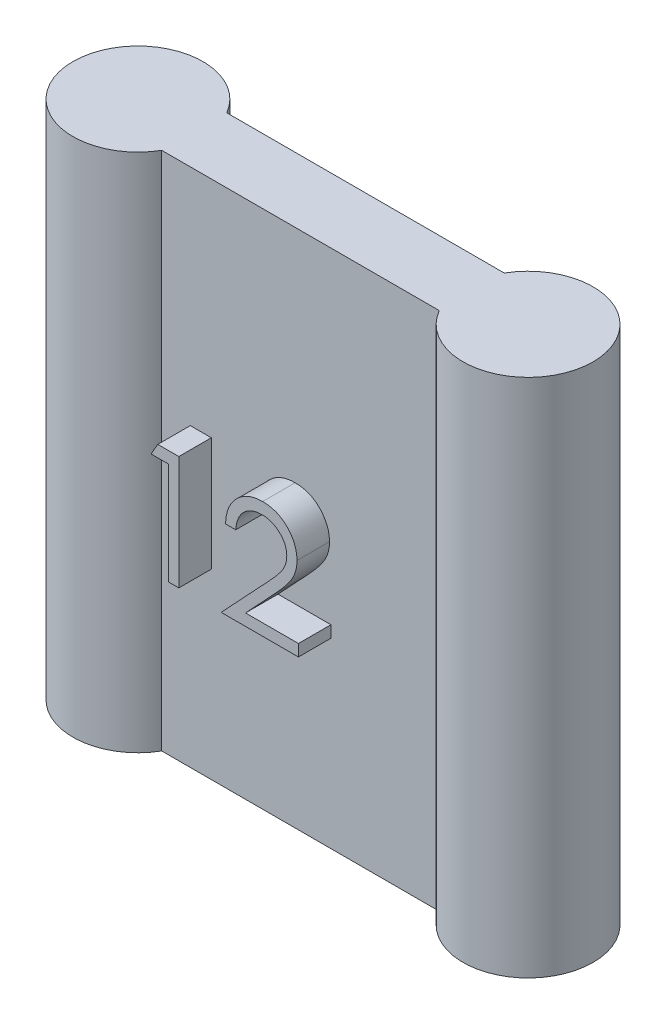
ISO-10303-21;
HEADER;
FILE_DESCRIPTION(('STEP AP214'),'2;1');
FILE_NAME('part.step','',(''),(''),'','','');
FILE_SCHEMA(('AUTOMOTIVE_DESIGN { 1 0 10303 214 1 1 1 1 }'));
ENDSEC;
DATA;
#1=APPLICATION_CONTEXT('core data for automotive mechanical design processes');
#2=APPLICATION_PROTOCOL_DEFINITION('international standard','automotive_design',2000,#1);
#3=PRODUCT_CONTEXT('',#1,'mechanical');
#4=PRODUCT('Part','Part','',(#3));
#5=PRODUCT_RELATED_PRODUCT_CATEGORY('part','',(#4));
#6=PRODUCT_DEFINITION_FORMATION('','',#4);
#7=PRODUCT_DEFINITION_CONTEXT('part definition',#1,'design');
#8=PRODUCT_DEFINITION('design','',#6,#7);
#9=PRODUCT_DEFINITION_SHAPE('','',#8);
#10=(LENGTH_UNIT() NAMED_UNIT(*) SI_UNIT(.MILLI.,.METRE.));
#11=(NAMED_UNIT(*) PLANE_ANGLE_UNIT() SI_UNIT($,.RADIAN.));
#12=(NAMED_UNIT(*) SI_UNIT($,.STERADIAN.) SOLID_ANGLE_UNIT());
#13=UNCERTAINTY_MEASURE_WITH_UNIT(LENGTH_MEASURE(1.E-05),#10,'distance_accuracy_value','');
#14=(GEOMETRIC_REPRESENTATION_CONTEXT(3) GLOBAL_UNCERTAINTY_ASSIGNED_CONTEXT((#13)) GLOBAL_UNIT_ASSIGNED_CONTEXT((#10,
#11,#12)) REPRESENTATION_CONTEXT('',''));
#15=CARTESIAN_POINT('',(0.,0.,0.));
#16=DIRECTION('',(0.,0.,1.));
#17=DIRECTION('',(1.,0.,0.));
#18=AXIS2_PLACEMENT_3D('',#15,#16,#17);
#19=CARTESIAN_POINT('',(6.,-8.,2.));
#20=DIRECTION('',(0.,1.,0.));
#21=DIRECTION('',(0.,0.,1.));
#22=AXIS2_PLACEMENT_3D('',#19,#20,#21);
#23=PLANE('',#22);
#24=DIRECTION('',(1.,0.,0.));
#25=VECTOR('',#24,1.);
#26=CARTESIAN_POINT('',(6.,-8.,0.));
#27=LINE('',#26,#25);
#28=CARTESIAN_POINT('',(-4.26794919243112,-8.,0.));
#29=VERTEX_POINT('',#28);
#30=CARTESIAN_POINT('',(4.26794919243113,-8.,0.));
#31=VERTEX_POINT('',#30);
#32=EDGE_CURVE('E291',#29,#31,#27,.T.);
#33=ORIENTED_EDGE('',*,*,#32,.T.);
#34=CARTESIAN_POINT('',(6.,-8.,1.));
#35=DIRECTION('',(0.,-1.,0.));
#36=DIRECTION('',(1.,0.,0.));
#37=AXIS2_PLACEMENT_3D('',#34,#35,#36);
#38=CIRCLE('',#37,2.);
#39=CARTESIAN_POINT('',(4.26794919243113,-8.,2.));
#40=VERTEX_POINT('',#39);
#41=EDGE_CURVE('E304',#31,#40,#38,.T.);
#42=ORIENTED_EDGE('',*,*,#41,.T.);
#43=DIRECTION('',(1.,0.,0.));
#44=VECTOR('',#43,1.);
#45=CARTESIAN_POINT('',(6.,-8.,2.));
#46=LINE('',#45,#44);
#47=CARTESIAN_POINT('',(-4.26794919243112,-8.,2.));
#48=VERTEX_POINT('',#47);
#49=EDGE_CURVE('E284',#48,#40,#46,.T.);
#50=ORIENTED_EDGE('',*,*,#49,.F.);
#51=CARTESIAN_POINT('',(-6.,-8.,1.));
#52=DIRECTION('',(0.,-1.,0.));
#53=DIRECTION('',(1.,0.,0.));
#54=AXIS2_PLACEMENT_3D('',#51,#52,#53);
#55=CIRCLE('',#54,2.);
#56=EDGE_CURVE('E299',#48,#29,#55,.T.);
#57=ORIENTED_EDGE('',*,*,#56,.T.);
#58=EDGE_LOOP('',(#33,#42,#50,#57));
#59=FACE_BOUND('',#58,.T.);
#60=ADVANCED_FACE('F33',(#59),#23,.F.);
#61=CARTESIAN_POINT('',(6.,8.,2.));
#62=DIRECTION('',(0.,-1.,0.));
#63=DIRECTION('',(0.,0.,-1.));
#64=AXIS2_PLACEMENT_3D('',#61,#62,#63);
#65=PLANE('',#64);
#66=DIRECTION('',(-1.,0.,0.));
#67=VECTOR('',#66,1.);
#68=CARTESIAN_POINT('',(6.,8.,2.));
#69=LINE('',#68,#67);
#70=CARTESIAN_POINT('',(4.26794919243112,8.,2.));
#71=VERTEX_POINT('',#70);
#72=CARTESIAN_POINT('',(-4.26794919243112,8.,2.));
#73=VERTEX_POINT('',#72);
#74=EDGE_CURVE('E276',#71,#73,#69,.T.);
#75=ORIENTED_EDGE('',*,*,#74,.F.);
#76=CARTESIAN_POINT('',(6.,8.,1.));
#77=DIRECTION('',(0.,-1.,0.));
#78=DIRECTION('',(0.,0.,-1.));
#79=AXIS2_PLACEMENT_3D('',#76,#77,#78);
#80=CIRCLE('',#79,2.);
#81=CARTESIAN_POINT('',(4.26794919243112,8.,0.));
#82=VERTEX_POINT('',#81);
#83=EDGE_CURVE('E277',#71,#82,#80,.F.);
#84=ORIENTED_EDGE('',*,*,#83,.T.);
#85=DIRECTION('',(-1.,0.,0.));
#86=VECTOR('',#85,1.);
#87=CARTESIAN_POINT('',(6.,8.,0.));
#88=LINE('',#87,#86);
#89=CARTESIAN_POINT('',(-4.26794919243112,8.,0.));
#90=VERTEX_POINT('',#89);
#91=EDGE_CURVE('E287',#82,#90,#88,.T.);
#92=ORIENTED_EDGE('',*,*,#91,.T.);
#93=CARTESIAN_POINT('',(-6.,8.,1.));
#94=DIRECTION('',(0.,-1.,0.));
#95=DIRECTION('',(0.,0.,-1.));
#96=AXIS2_PLACEMENT_3D('',#93,#94,#95);
#97=CIRCLE('',#96,2.);
#98=EDGE_CURVE('E279',#90,#73,#97,.F.);
#99=ORIENTED_EDGE('',*,*,#98,.T.);
#100=EDGE_LOOP('',(#75,#84,#92,#99));
#101=FACE_BOUND('',#100,.T.);
#102=ADVANCED_FACE('F264',(#101),#65,.F.);
#103=CARTESIAN_POINT('',(0.,0.,2.));
#104=DIRECTION('',(0.,0.,-1.));
#105=DIRECTION('',(-1.,0.,0.));
#106=AXIS2_PLACEMENT_3D('',#103,#104,#105);
#107=PLANE('',#106);
#108=CARTESIAN_POINT('',(0.578204653722721,0.127970887786358,2.));
#109=CARTESIAN_POINT('',(0.577568911423302,0.151852286197168,2.));
#110=CARTESIAN_POINT('',(0.576315985431715,0.198917936558474,2.));
#111=CARTESIAN_POINT('',(0.565258287937912,0.267923695577093,2.));
#112=CARTESIAN_POINT('',(0.548547781843404,0.334488509392884,2.));
#113=CARTESIAN_POINT('',(0.524602523795471,0.39881712851072,2.));
#114=CARTESIAN_POINT('',(0.492995783710131,0.460262780576897,2.));
#115=CARTESIAN_POINT('',(0.454522403792534,0.518900260780499,2.));
#116=CARTESIAN_POINT('',(0.410132340374669,0.575589225980579,2.));
#117=CARTESIAN_POINT('',(0.358781071043801,0.628742524038654,2.));
#118=CARTESIAN_POINT('',(0.302369551237218,0.677423729521116,2.));
#119=CARTESIAN_POINT('',(0.242775301651988,0.720547814935484,2.));
#120=CARTESIAN_POINT('',(0.179725197392077,0.756586925734305,2.));
#121=CARTESIAN_POINT('',(0.113485075216256,0.786130422914732,2.));
#122=CARTESIAN_POINT('',(0.0442396058079003,0.809305804111072,2.));
#123=CARTESIAN_POINT('',(-0.0281451393144922,0.82536438353418,2.));
#124=CARTESIAN_POINT('',(-0.103469155596994,0.835446867480815,2.));
#125=CARTESIAN_POINT('',(-0.154902651287634,0.836811039389183,2.));
#126=CARTESIAN_POINT('',(-0.181110250123432,0.837506144196614,2.));
#127=B_SPLINE_CURVE_WITH_KNOTS('',3,(#108,#109,#110,#111,#112,#113,#114,#115,#116,#117,#118,
#119,#120,#121,#122,#123,#124,#125,#126),.UNSPECIFIED.,.F.,.F.,(4,1,1,1,1,1,1,1,1,1,1,1,1,1,1,1,
4),(0.,0.0619654006870625,0.122121905638296,0.180988496849842,0.239933216451903,
0.299905831106524,0.359988847476987,0.421775741741646,0.486575826421126,0.551534804619741,
0.61501754275998,0.677258616661657,0.739729962362713,0.803050102662951,0.866495132015698,
0.931973474177149,1.),.UNSPECIFIED.);
#128=CARTESIAN_POINT('',(0.578204653722721,0.127970887786358,2.));
#129=VERTEX_POINT('',#128);
#130=CARTESIAN_POINT('',(-0.181110250123432,0.837506144196614,2.));
#131=VERTEX_POINT('',#130);
#132=EDGE_CURVE('E207',#129,#131,#127,.T.);
#133=ORIENTED_EDGE('',*,*,#132,.T.);
#134=CARTESIAN_POINT('',(-0.181110250123432,0.837506144196614,2.));
#135=CARTESIAN_POINT('',(-0.208481082879757,0.836791111932682,2.));
#136=CARTESIAN_POINT('',(-0.262232879099316,0.835386906628318,2.));
#137=CARTESIAN_POINT('',(-0.341151912035856,0.825564242636293,2.));
#138=CARTESIAN_POINT('',(-0.416437689559718,0.808618402239357,2.));
#139=CARTESIAN_POINT('',(-0.488279592512636,0.78544172785234,2.));
#140=CARTESIAN_POINT('',(-0.556799178325362,0.755983179030015,2.));
#141=CARTESIAN_POINT('',(-0.621663222362686,0.719291434351245,2.));
#142=CARTESIAN_POINT('',(-0.682726111622604,0.675507941198702,2.));
#143=CARTESIAN_POINT('',(-0.740102634968096,0.625867384874658,2.));
#144=CARTESIAN_POINT('',(-0.792966614031641,0.570599783658731,2.));
#145=CARTESIAN_POINT('',(-0.839413489896559,0.508989820591785,2.));
#146=CARTESIAN_POINT('',(-0.879997504040192,0.442162405220692,2.));
#147=CARTESIAN_POINT('',(-0.91540673751999,0.370297854651341,2.));
#148=CARTESIAN_POINT('',(-0.94416242760276,0.292744074666832,2.));
#149=CARTESIAN_POINT('',(-0.966135578033861,0.209776369818383,2.));
#150=CARTESIAN_POINT('',(-0.983522424755474,0.121754988379835,2.));
#151=CARTESIAN_POINT('',(-0.989330945360324,0.0609699035232617,2.));
#152=CARTESIAN_POINT('',(-0.992308166790099,0.0298138365043064,2.));
#153=B_SPLINE_CURVE_WITH_KNOTS('',3,(#134,#135,#136,#137,#138,#139,#140,#141,#142,#143,#144,
#145,#146,#147,#148,#149,#150,#151,#152),.UNSPECIFIED.,.F.,.F.,(4,1,1,1,1,1,1,1,1,1,1,1,1,1,1,1,
4),(0.,0.0644386715952429,0.126546911271678,0.186887153436571,0.245877535589455,
0.304040884691267,0.362191218072661,0.420975932791645,0.480660283279666,0.540600274953758,
0.600689098349453,0.661935789757195,0.724442505913983,0.789038393881744,0.856313757050995,
0.926352028205863,1.),.UNSPECIFIED.);
#154=CARTESIAN_POINT('',(-0.992308166790099,0.0298138365043064,2.));
#155=VERTEX_POINT('',#154);
#156=EDGE_CURVE('E427',#131,#155,#153,.T.);
#157=ORIENTED_EDGE('',*,*,#156,.T.);
#158=DIRECTION('',(-1.,0.,0.));
#159=VECTOR('',#158,1.);
#160=CARTESIAN_POINT('',(-0.992308166790099,0.0298138365043064,2.));
#161=LINE('',#160,#159);
#162=CARTESIAN_POINT('',(-1.30641073089266,0.0298138365043064,2.));
#163=VERTEX_POINT('',#162);
#164=EDGE_CURVE('E186',#155,#163,#161,.T.);
#165=ORIENTED_EDGE('',*,*,#164,.T.);
#166=CARTESIAN_POINT('',(-1.30641073089266,0.0298138365043064,2.));
#167=CARTESIAN_POINT('',(-1.30436357788473,0.0714847242721028,2.));
#168=CARTESIAN_POINT('',(-1.30034302385872,0.153325238847007,2.));
#169=CARTESIAN_POINT('',(-1.28151473459698,0.272649145246096,2.));
#170=CARTESIAN_POINT('',(-1.25457385739211,0.386703943970959,2.));
#171=CARTESIAN_POINT('',(-1.2164824033773,0.494573857940616,2.));
#172=CARTESIAN_POINT('',(-1.16917612560754,0.597212665170941,2.));
#173=CARTESIAN_POINT('',(-1.11244609822664,0.694212680862224,2.));
#174=CARTESIAN_POINT('',(-1.04525224771322,0.785203869576829,2.));
#175=CARTESIAN_POINT('',(-0.969045513667793,0.869342712872297,2.));
#176=CARTESIAN_POINT('',(-0.886276874612791,0.946530283671633,2.));
#177=CARTESIAN_POINT('',(-0.796970935141752,1.0131855264778,2.));
#178=CARTESIAN_POINT('',(-0.703125907855446,1.06950319783977,2.));
#179=CARTESIAN_POINT('',(-0.605026508890053,1.11658443966362,2.));
#180=CARTESIAN_POINT('',(-0.501565945330598,1.15192428558615,2.));
#181=CARTESIAN_POINT('',(-0.393683087491155,1.17814592519074,2.));
#182=CARTESIAN_POINT('',(-0.280903951081718,1.19392227091231,2.));
#183=CARTESIAN_POINT('',(-0.204063929034784,1.19561805651661,2.));
#184=CARTESIAN_POINT('',(-0.164984448841381,1.19648050317097,2.));
#185=B_SPLINE_CURVE_WITH_KNOTS('',3,(#166,#167,#168,#169,#170,#171,#172,#173,#174,#175,#176,
#177,#178,#179,#180,#181,#182,#183,#184),.UNSPECIFIED.,.F.,.F.,(4,1,1,1,1,1,1,1,1,1,1,1,1,1,1,1,
4),(0.,0.0687907943906181,0.135103289431128,0.198978674310651,0.261904299780856,
0.323494969367969,0.385195377966051,0.446969238740774,0.509764776703132,0.572250568847368,
0.633405175661153,0.693251162921753,0.75258316278567,0.812579266153421,0.873275084920192,
0.935549942895029,1.),.UNSPECIFIED.);
#186=CARTESIAN_POINT('',(-0.164984448841381,1.19648050317097,2.));
#187=VERTEX_POINT('',#186);
#188=EDGE_CURVE('E47',#163,#187,#185,.T.);
#189=ORIENTED_EDGE('',*,*,#188,.T.);
#190=CARTESIAN_POINT('',(-0.164984448841381,1.19648050317097,2.));
#191=CARTESIAN_POINT('',(-0.126606374754038,1.19558204672555,2.));
#192=CARTESIAN_POINT('',(-0.0511948300976275,1.19381661190456,2.));
#193=CARTESIAN_POINT('',(0.0588671843552584,1.17865558263733,2.));
#194=CARTESIAN_POINT('',(0.163644478818641,1.15490999100204,2.));
#195=CARTESIAN_POINT('',(0.262932245340542,1.12159457468874,2.));
#196=CARTESIAN_POINT('',(0.355938309911792,1.07681014729621,2.));
#197=CARTESIAN_POINT('',(0.44336135446814,1.02301260863806,2.));
#198=CARTESIAN_POINT('',(0.52624216525914,0.960792777265897,2.));
#199=CARTESIAN_POINT('',(0.600848948871302,0.887538963817508,2.));
#200=CARTESIAN_POINT('',(0.669357028107557,0.809336579347145,2.));
#201=CARTESIAN_POINT('',(0.728459283251832,0.725848675734995,2.));
#202=CARTESIAN_POINT('',(0.779072446725158,0.639619390019976,2.));
#203=CARTESIAN_POINT('',(0.821260126606338,0.549991188438465,2.));
#204=CARTESIAN_POINT('',(0.852316265545468,0.456120160025773,2.));
#205=CARTESIAN_POINT('',(0.875894473574838,0.359372957234126,2.));
#206=CARTESIAN_POINT('',(0.88922188726293,0.258748146227562,2.));
#207=CARTESIAN_POINT('',(0.891267310760781,0.190641590579818,2.));
#208=CARTESIAN_POINT('',(0.892307217825286,0.15601575958123,2.));
#209=B_SPLINE_CURVE_WITH_KNOTS('',3,(#190,#191,#192,#193,#194,#195,#196,#197,#198,#199,#200,
#201,#202,#203,#204,#205,#206,#207,#208),.UNSPECIFIED.,.F.,.F.,(4,1,1,1,1,1,1,1,1,1,1,1,1,1,1,1,
4),(0.,0.0694754602496704,0.136516797617799,0.200788823609261,0.263829672855826,
0.32573502296542,0.387290692215291,0.449509218762603,0.512967819545441,0.576275215493061,
0.637580100263924,0.697902605917102,0.757172088426985,0.816598528488655,0.87665317089282,
0.93728964241024,1.),.UNSPECIFIED.);
#210=CARTESIAN_POINT('',(0.892307217825286,0.15601575958123,2.));
#211=VERTEX_POINT('',#210);
#212=EDGE_CURVE('E409',#187,#211,#209,.T.);
#213=ORIENTED_EDGE('',*,*,#212,.T.);
#214=CARTESIAN_POINT('',(0.892307217825286,0.15601575958123,2.));
#215=CARTESIAN_POINT('',(0.890613954968804,0.107267925006404,2.));
#216=CARTESIAN_POINT('',(0.887257143621635,0.0106277113358799,2.));
#217=CARTESIAN_POINT('',(0.858542767054218,-0.131387151413306,2.));
#218=CARTESIAN_POINT('',(0.813696255958765,-0.268980570499981,2.));
#219=CARTESIAN_POINT('',(0.759698899109418,-0.379717872584427,2.));
#220=CARTESIAN_POINT('',(0.705226455047737,-0.468951366341458,2.));
#221=CARTESIAN_POINT('',(0.656138947454091,-0.5424200712612,2.));
#222=CARTESIAN_POINT('',(0.598674136432285,-0.621525539650599,2.));
#223=CARTESIAN_POINT('',(0.531995638469596,-0.706002877024552,2.));
#224=CARTESIAN_POINT('',(0.457482766318859,-0.796513782123112,2.));
#225=CARTESIAN_POINT('',(0.374460602962224,-0.89300357752152,2.));
#226=CARTESIAN_POINT('',(0.282337120940826,-0.994475347341573,2.));
#227=CARTESIAN_POINT('',(0.217678620186486,-1.0637809487294,2.));
#228=CARTESIAN_POINT('',(0.184174205004773,-1.09969337503416,2.));
#229=B_SPLINE_CURVE_WITH_KNOTS('',3,(#214,#215,#216,#217,#218,#219,#220,#221,#222,#223,#224,
#225,#226,#227,#228),.UNSPECIFIED.,.F.,.F.,(4,1,1,1,1,1,1,1,1,1,1,1,4),(0.,0.0987021963061527,
0.195672308810664,0.292422426507954,0.391342543799825,0.444462440671892,0.504228775449316,
0.570352337994678,0.642545753097748,0.722287505344018,0.807921122682712,0.900469537985015,1.),.UNSPECIFIED.);
#230=CARTESIAN_POINT('',(0.184174205004773,-1.09969337503416,2.));
#231=VERTEX_POINT('',#230);
#232=EDGE_CURVE('E404',#211,#231,#229,.T.);
#233=ORIENTED_EDGE('',*,*,#232,.T.);
#234=DIRECTION('',(-0.683740795861405,-0.729724964678345,0.));
#235=VECTOR('',#234,1.);
#236=CARTESIAN_POINT('',(0.184174205004773,-1.09969337503416,2.));
#237=LINE('',#236,#235);
#238=CARTESIAN_POINT('',(-0.691526916790099,-2.03428872759826,2.));
#239=VERTEX_POINT('',#238);
#240=EDGE_CURVE('E401',#231,#239,#237,.T.);
#241=ORIENTED_EDGE('',*,*,#240,.T.);
#242=DIRECTION('',(1.,0.,0.));
#243=VECTOR('',#242,1.);
#244=CARTESIAN_POINT('',(-0.691526916790099,-2.03428872759826,2.));
#245=LINE('',#244,#243);
#246=CARTESIAN_POINT('',(0.93717901269708,-2.03428872759826,2.));
#247=VERTEX_POINT('',#246);
#248=EDGE_CURVE('E398',#239,#247,#245,.T.);
#249=ORIENTED_EDGE('',*,*,#248,.T.);
#250=DIRECTION('',(0.,-1.,0.));
#251=VECTOR('',#250,1.);
#252=CARTESIAN_POINT('',(0.93717901269708,-2.03428872759826,2.));
#253=LINE('',#252,#251);
#254=CARTESIAN_POINT('',(0.93717901269708,-2.39326308657262,2.));
#255=VERTEX_POINT('',#254);
#256=EDGE_CURVE('E395',#247,#255,#253,.T.);
#257=ORIENTED_EDGE('',*,*,#256,.T.);
#258=DIRECTION('',(-1.,0.,0.));
#259=VECTOR('',#258,1.);
#260=CARTESIAN_POINT('',(0.93717901269708,-2.39326308657262,2.));
#261=LINE('',#260,#259);
#262=CARTESIAN_POINT('',(-1.44102611550805,-2.39326308657262,2.));
#263=VERTEX_POINT('',#262);
#264=EDGE_CURVE('E392',#255,#263,#261,.T.);
#265=ORIENTED_EDGE('',*,*,#264,.T.);
#266=DIRECTION('',(0.683776631973393,0.729691385153424,0.));
#267=VECTOR('',#266,1.);
#268=CARTESIAN_POINT('',(-1.44102611550805,-2.39326308657262,2.));
#269=LINE('',#268,#267);
#270=CARTESIAN_POINT('',(-0.0836543206362529,-0.944745458367489,2.));
#271=VERTEX_POINT('',#270);
#272=EDGE_CURVE('E386',#263,#271,#269,.T.);
#273=ORIENTED_EDGE('',*,*,#272,.T.);
#274=CARTESIAN_POINT('',(-0.0836543206362529,-0.944745458367489,2.));
#275=CARTESIAN_POINT('',(-0.0506064338283985,-0.910247151818881,2.));
#276=CARTESIAN_POINT('',(0.0128717932905046,-0.843982965214682,2.));
#277=CARTESIAN_POINT('',(0.102654370099705,-0.747240005080661,2.));
#278=CARTESIAN_POINT('',(0.18329335841211,-0.657490464328541,2.));
#279=CARTESIAN_POINT('',(0.255310751183933,-0.574903915884057,2.));
#280=CARTESIAN_POINT('',(0.317144256549756,-0.498272348088539,2.));
#281=CARTESIAN_POINT('',(0.372016488497533,-0.430077644500787,2.));
#282=CARTESIAN_POINT('',(0.415982079479605,-0.367323194192879,2.));
#283=CARTESIAN_POINT('',(0.463697475167276,-0.294582580280349,2.));
#284=CARTESIAN_POINT('',(0.509911456565501,-0.205770263106293,2.));
#285=CARTESIAN_POINT('',(0.549623812605896,-0.0972365738452463,2.));
#286=CARTESIAN_POINT('',(0.573838661054518,0.0144906788307417,2.));
#287=CARTESIAN_POINT('',(0.576743496560344,0.0899927158780106,2.));
#288=CARTESIAN_POINT('',(0.578204653722721,0.127970887786358,2.));
#289=B_SPLINE_CURVE_WITH_KNOTS('',3,(#274,#275,#276,#277,#278,#279,#280,#281,#282,#283,#284,
#285,#286,#287,#288),.UNSPECIFIED.,.F.,.F.,(4,1,1,1,1,1,1,1,1,1,1,1,4),(0.,0.110802643801319,
0.21282920234777,0.306101309823111,0.39064732111601,0.466924469360852,0.534481039284031,
0.593586940965673,0.644557004508718,0.736200452629373,0.825024025618864,0.911985584829758,1.),.UNSPECIFIED.);
#290=EDGE_CURVE('E210',#271,#129,#289,.T.);
#291=ORIENTED_EDGE('',*,*,#290,.T.);
#292=EDGE_LOOP('',(#133,#157,#165,#189,#213,#233,#241,#249,#257,#265,#273,#291));
#293=FACE_BOUND('',#292,.T.);
#294=DIRECTION('',(-1.,0.,0.));
#295=VECTOR('',#294,1.);
#296=CARTESIAN_POINT('',(-3.05641073089266,0.747762554453025,2.));
#297=LINE('',#296,#295);
#298=CARTESIAN_POINT('',(-3.05641073089266,0.747762554453025,2.));
#299=VERTEX_POINT('',#298);
#300=CARTESIAN_POINT('',(-3.5948722693542,0.747762554453025,2.));
#301=VERTEX_POINT('',#300);
#302=EDGE_CURVE('E324',#299,#301,#297,.T.);
#303=ORIENTED_EDGE('',*,*,#302,.T.);
#304=DIRECTION('',(0.496686511837685,0.867930013859708,0.));
#305=VECTOR('',#304,1.);
#306=CARTESIAN_POINT('',(-3.5948722693542,0.747762554453025,2.));
#307=LINE('',#306,#305);
#308=CARTESIAN_POINT('',(-3.38944358345677,1.10673691342738,2.));
#309=VERTEX_POINT('',#308);
#310=EDGE_CURVE('E338',#301,#309,#307,.T.);
#311=ORIENTED_EDGE('',*,*,#310,.T.);
#312=DIRECTION('',(1.,0.,0.));
#313=VECTOR('',#312,1.);
#314=CARTESIAN_POINT('',(-3.38944358345677,1.10673691342738,2.));
#315=LINE('',#314,#313);
#316=CARTESIAN_POINT('',(-2.7423081667901,1.10673691342738,2.));
#317=VERTEX_POINT('',#316);
#318=EDGE_CURVE('E335',#309,#317,#315,.T.);
#319=ORIENTED_EDGE('',*,*,#318,.T.);
#320=DIRECTION('',(0.,-1.,0.));
#321=VECTOR('',#320,1.);
#322=CARTESIAN_POINT('',(-2.7423081667901,1.10673691342738,2.));
#323=LINE('',#322,#321);
#324=CARTESIAN_POINT('',(-2.7423081667901,-2.39326308657262,2.));
#325=VERTEX_POINT('',#324);
#326=EDGE_CURVE('E55',#317,#325,#323,.T.);
#327=ORIENTED_EDGE('',*,*,#326,.T.);
#328=DIRECTION('',(-1.,0.,0.));
#329=VECTOR('',#328,1.);
#330=CARTESIAN_POINT('',(-2.7423081667901,-2.39326308657262,2.));
#331=LINE('',#330,#329);
#332=CARTESIAN_POINT('',(-3.05641073089266,-2.39326308657262,2.));
#333=VERTEX_POINT('',#332);
#334=EDGE_CURVE('E331',#325,#333,#331,.T.);
#335=ORIENTED_EDGE('',*,*,#334,.T.);
#336=DIRECTION('',(0.,1.,0.));
#337=VECTOR('',#336,1.);
#338=CARTESIAN_POINT('',(-3.05641073089266,-2.39326308657262,2.));
#339=LINE('',#338,#337);
#340=EDGE_CURVE('E328',#333,#299,#339,.T.);
#341=ORIENTED_EDGE('',*,*,#340,.T.);
#342=EDGE_LOOP('',(#303,#311,#319,#327,#335,#341));
#343=FACE_BOUND('',#342,.T.);
#344=ORIENTED_EDGE('',*,*,#49,.T.);
#345=DIRECTION('',(0.,-1.,0.));
#346=VECTOR('',#345,1.);
#347=CARTESIAN_POINT('',(4.26794919243112,13.6568542494924,2.));
#348=LINE('',#347,#346);
#349=EDGE_CURVE('E305',#40,#71,#348,.F.);
#350=ORIENTED_EDGE('',*,*,#349,.T.);
#351=ORIENTED_EDGE('',*,*,#74,.T.);
#352=DIRECTION('',(0.,-1.,0.));
#353=VECTOR('',#352,1.);
#354=CARTESIAN_POINT('',(-4.26794919243113,13.6568542494924,2.));
#355=LINE('',#354,#353);
#356=EDGE_CURVE('E294',#73,#48,#355,.T.);
#357=ORIENTED_EDGE('',*,*,#356,.T.);
#358=EDGE_LOOP('',(#344,#350,#351,#357));
#359=FACE_BOUND('',#358,.T.);
#360=ADVANCED_FACE('F261',(#293,#343,#359),#107,.F.);
#361=CARTESIAN_POINT('',(0.,0.,0.));
#362=DIRECTION('',(0.,0.,-1.));
#363=DIRECTION('',(-1.,0.,0.));
#364=AXIS2_PLACEMENT_3D('',#361,#362,#363);
#365=PLANE('',#364);
#366=DIRECTION('',(0.,-1.,0.));
#367=VECTOR('',#366,1.);
#368=CARTESIAN_POINT('',(4.26794919243112,13.6568542494924,0.));
#369=LINE('',#368,#367);
#370=EDGE_CURVE('E11',#31,#82,#369,.F.);
#371=ORIENTED_EDGE('',*,*,#370,.F.);
#372=ORIENTED_EDGE('',*,*,#32,.F.);
#373=DIRECTION('',(0.,-1.,0.));
#374=VECTOR('',#373,1.);
#375=CARTESIAN_POINT('',(-4.26794919243113,13.6568542494924,0.));
#376=LINE('',#375,#374);
#377=EDGE_CURVE('E40',#90,#29,#376,.T.);
#378=ORIENTED_EDGE('',*,*,#377,.F.);
#379=ORIENTED_EDGE('',*,*,#91,.F.);
#380=EDGE_LOOP('',(#371,#372,#378,#379));
#381=FACE_BOUND('',#380,.T.);
#382=ADVANCED_FACE('F259',(#381),#365,.T.);
#383=CARTESIAN_POINT('',(-6.,13.6568542494924,1.));
#384=DIRECTION('',(0.,-1.,0.));
#385=DIRECTION('',(1.,0.,0.));
#386=AXIS2_PLACEMENT_3D('',#383,#384,#385);
#387=CYLINDRICAL_SURFACE('',#386,2.);
#388=ORIENTED_EDGE('',*,*,#356,.F.);
#389=ORIENTED_EDGE('',*,*,#98,.F.);
#390=ORIENTED_EDGE('',*,*,#377,.T.);
#391=ORIENTED_EDGE('',*,*,#56,.F.);
#392=EDGE_LOOP('',(#388,#389,#390,#391));
#393=FACE_BOUND('',#392,.T.);
#394=ADVANCED_FACE('F255',(#393),#387,.T.);
#395=CARTESIAN_POINT('',(6.,13.6568542494924,1.));
#396=DIRECTION('',(0.,-1.,0.));
#397=DIRECTION('',(1.,0.,0.));
#398=AXIS2_PLACEMENT_3D('',#395,#396,#397);
#399=CYLINDRICAL_SURFACE('',#398,2.);
#400=ORIENTED_EDGE('',*,*,#349,.F.);
#401=ORIENTED_EDGE('',*,*,#41,.F.);
#402=ORIENTED_EDGE('',*,*,#370,.T.);
#403=ORIENTED_EDGE('',*,*,#83,.F.);
#404=EDGE_LOOP('',(#400,#401,#402,#403));
#405=FACE_BOUND('',#404,.T.);
#406=ADVANCED_FACE('F251',(#405),#399,.T.);
#407=CARTESIAN_POINT('',(-3.5948722693542,0.747762554453025,3.));
#408=DIRECTION('',(-0.867930013859708,0.496686511837685,0.));
#409=DIRECTION('',(-0.496686511837686,-0.867930013859708,0.));
#410=AXIS2_PLACEMENT_3D('',#407,#408,#409);
#411=PLANE('',#410);
#412=ORIENTED_EDGE('',*,*,#310,.F.);
#413=DIRECTION('',(0.,0.,-1.));
#414=VECTOR('',#413,1.);
#415=CARTESIAN_POINT('',(-3.5948722693542,0.747762554453025,3.));
#416=LINE('',#415,#414);
#417=CARTESIAN_POINT('',(-3.5948722693542,0.747762554453025,3.));
#418=VERTEX_POINT('',#417);
#419=EDGE_CURVE('E309',#418,#301,#416,.T.);
#420=ORIENTED_EDGE('',*,*,#419,.F.);
#421=DIRECTION('',(0.496686511837685,0.867930013859708,0.));
#422=VECTOR('',#421,1.);
#423=CARTESIAN_POINT('',(-3.5948722693542,0.747762554453025,3.));
#424=LINE('',#423,#422);
#425=CARTESIAN_POINT('',(-3.38944358345677,1.10673691342738,3.));
#426=VERTEX_POINT('',#425);
#427=EDGE_CURVE('E327',#418,#426,#424,.T.);
#428=ORIENTED_EDGE('',*,*,#427,.T.);
#429=DIRECTION('',(0.,0.,-1.));
#430=VECTOR('',#429,1.);
#431=CARTESIAN_POINT('',(-3.38944358345677,1.10673691342738,3.));
#432=LINE('',#431,#430);
#433=EDGE_CURVE('E312',#426,#309,#432,.T.);
#434=ORIENTED_EDGE('',*,*,#433,.T.);
#435=EDGE_LOOP('',(#412,#420,#428,#434));
#436=FACE_BOUND('',#435,.T.);
#437=ADVANCED_FACE('F234',(#436),#411,.T.);
#438=CARTESIAN_POINT('',(-3.05641073089266,0.747762554453025,3.));
#439=DIRECTION('',(0.,-1.,0.));
#440=DIRECTION('',(0.,0.,-1.));
#441=AXIS2_PLACEMENT_3D('',#438,#439,#440);
#442=PLANE('',#441);
#443=ORIENTED_EDGE('',*,*,#302,.F.);
#444=DIRECTION('',(0.,0.,-1.));
#445=VECTOR('',#444,1.);
#446=CARTESIAN_POINT('',(-3.05641073089266,0.747762554453025,3.));
#447=LINE('',#446,#445);
#448=CARTESIAN_POINT('',(-3.05641073089266,0.747762554453025,3.));
#449=VERTEX_POINT('',#448);
#450=EDGE_CURVE('E321',#449,#299,#447,.T.);
#451=ORIENTED_EDGE('',*,*,#450,.F.);
#452=DIRECTION('',(-1.,0.,0.));
#453=VECTOR('',#452,1.);
#454=CARTESIAN_POINT('',(-3.05641073089266,0.747762554453025,3.));
#455=LINE('',#454,#453);
#456=EDGE_CURVE('E315',#449,#418,#455,.T.);
#457=ORIENTED_EDGE('',*,*,#456,.T.);
#458=ORIENTED_EDGE('',*,*,#419,.T.);
#459=EDGE_LOOP('',(#443,#451,#457,#458));
#460=FACE_BOUND('',#459,.T.);
#461=ADVANCED_FACE('F230',(#460),#442,.T.);
#462=CARTESIAN_POINT('',(-3.05641073089266,-2.39326308657262,3.));
#463=DIRECTION('',(-1.,0.,0.));
#464=DIRECTION('',(0.,0.,1.));
#465=AXIS2_PLACEMENT_3D('',#462,#463,#464);
#466=PLANE('',#465);
#467=ORIENTED_EDGE('',*,*,#340,.F.);
#468=DIRECTION('',(0.,0.,-1.));
#469=VECTOR('',#468,1.);
#470=CARTESIAN_POINT('',(-3.05641073089266,-2.39326308657262,3.));
#471=LINE('',#470,#469);
#472=CARTESIAN_POINT('',(-3.05641073089266,-2.39326308657262,3.));
#473=VERTEX_POINT('',#472);
#474=EDGE_CURVE('E319',#473,#333,#471,.T.);
#475=ORIENTED_EDGE('',*,*,#474,.F.);
#476=DIRECTION('',(0.,1.,0.));
#477=VECTOR('',#476,1.);
#478=CARTESIAN_POINT('',(-3.05641073089266,-2.39326308657262,3.));
#479=LINE('',#478,#477);
#480=EDGE_CURVE('E343',#473,#449,#479,.T.);
#481=ORIENTED_EDGE('',*,*,#480,.T.);
#482=ORIENTED_EDGE('',*,*,#450,.T.);
#483=EDGE_LOOP('',(#467,#475,#481,#482));
#484=FACE_BOUND('',#483,.T.);
#485=ADVANCED_FACE('F233',(#484),#466,.T.);
#486=CARTESIAN_POINT('',(-2.7423081667901,-2.39326308657262,3.));
#487=DIRECTION('',(0.,-1.,0.));
#488=DIRECTION('',(0.,0.,-1.));
#489=AXIS2_PLACEMENT_3D('',#486,#487,#488);
#490=PLANE('',#489);
#491=ORIENTED_EDGE('',*,*,#334,.F.);
#492=DIRECTION('',(0.,0.,-1.));
#493=VECTOR('',#492,1.);
#494=CARTESIAN_POINT('',(-2.7423081667901,-2.39326308657262,3.));
#495=LINE('',#494,#493);
#496=CARTESIAN_POINT('',(-2.7423081667901,-2.39326308657262,3.));
#497=VERTEX_POINT('',#496);
#498=EDGE_CURVE('E317',#497,#325,#495,.T.);
#499=ORIENTED_EDGE('',*,*,#498,.F.);
#500=DIRECTION('',(-1.,0.,0.));
#501=VECTOR('',#500,1.);
#502=CARTESIAN_POINT('',(-2.7423081667901,-2.39326308657262,3.));
#503=LINE('',#502,#501);
#504=EDGE_CURVE('E346',#497,#473,#503,.T.);
#505=ORIENTED_EDGE('',*,*,#504,.T.);
#506=ORIENTED_EDGE('',*,*,#474,.T.);
#507=EDGE_LOOP('',(#491,#499,#505,#506));
#508=FACE_BOUND('',#507,.T.);
#509=ADVANCED_FACE('F238',(#508),#490,.T.);
#510=CARTESIAN_POINT('',(-2.7423081667901,1.10673691342738,3.));
#511=DIRECTION('',(1.,0.,0.));
#512=DIRECTION('',(0.,0.,-1.));
#513=AXIS2_PLACEMENT_3D('',#510,#511,#512);
#514=PLANE('',#513);
#515=ORIENTED_EDGE('',*,*,#326,.F.);
#516=DIRECTION('',(0.,0.,-1.));
#517=VECTOR('',#516,1.);
#518=CARTESIAN_POINT('',(-2.7423081667901,1.10673691342738,3.));
#519=LINE('',#518,#517);
#520=CARTESIAN_POINT('',(-2.7423081667901,1.10673691342738,3.));
#521=VERTEX_POINT('',#520);
#522=EDGE_CURVE('E314',#521,#317,#519,.T.);
#523=ORIENTED_EDGE('',*,*,#522,.F.);
#524=DIRECTION('',(0.,-1.,0.));
#525=VECTOR('',#524,1.);
#526=CARTESIAN_POINT('',(-2.7423081667901,1.10673691342738,3.));
#527=LINE('',#526,#525);
#528=EDGE_CURVE('E349',#521,#497,#527,.T.);
#529=ORIENTED_EDGE('',*,*,#528,.T.);
#530=ORIENTED_EDGE('',*,*,#498,.T.);
#531=EDGE_LOOP('',(#515,#523,#529,#530));
#532=FACE_BOUND('',#531,.T.);
#533=ADVANCED_FACE('F242',(#532),#514,.T.);
#534=CARTESIAN_POINT('',(-3.38944358345677,1.10673691342738,3.));
#535=DIRECTION('',(0.,1.,0.));
#536=DIRECTION('',(0.,0.,1.));
#537=AXIS2_PLACEMENT_3D('',#534,#535,#536);
#538=PLANE('',#537);
#539=ORIENTED_EDGE('',*,*,#318,.F.);
#540=ORIENTED_EDGE('',*,*,#433,.F.);
#541=DIRECTION('',(1.,0.,0.));
#542=VECTOR('',#541,1.);
#543=CARTESIAN_POINT('',(-3.38944358345677,1.10673691342738,3.));
#544=LINE('',#543,#542);
#545=EDGE_CURVE('E352',#426,#521,#544,.T.);
#546=ORIENTED_EDGE('',*,*,#545,.T.);
#547=ORIENTED_EDGE('',*,*,#522,.T.);
#548=EDGE_LOOP('',(#539,#540,#546,#547));
#549=FACE_BOUND('',#548,.T.);
#550=ADVANCED_FACE('F228',(#549),#538,.T.);
#551=CARTESIAN_POINT('',(0.,0.,3.));
#552=DIRECTION('',(0.,0.,-1.));
#553=DIRECTION('',(-1.,0.,0.));
#554=AXIS2_PLACEMENT_3D('',#551,#552,#553);
#555=PLANE('',#554);
#556=ORIENTED_EDGE('',*,*,#427,.F.);
#557=ORIENTED_EDGE('',*,*,#456,.F.);
#558=ORIENTED_EDGE('',*,*,#480,.F.);
#559=ORIENTED_EDGE('',*,*,#504,.F.);
#560=ORIENTED_EDGE('',*,*,#528,.F.);
#561=ORIENTED_EDGE('',*,*,#545,.F.);
#562=EDGE_LOOP('',(#556,#557,#558,#559,#560,#561));
#563=FACE_BOUND('',#562,.T.);
#564=ADVANCED_FACE('F224',(#563),#555,.F.);
#565=CARTESIAN_POINT('',(-0.181110250123432,0.837506144196614,3.));
#566=CARTESIAN_POINT('',(-0.208481082879757,0.836791111932682,3.));
#567=CARTESIAN_POINT('',(-0.262232879099316,0.835386906628318,3.));
#568=CARTESIAN_POINT('',(-0.341151912035856,0.825564242636293,3.));
#569=CARTESIAN_POINT('',(-0.416437689559718,0.808618402239357,3.));
#570=CARTESIAN_POINT('',(-0.488279592512636,0.78544172785234,3.));
#571=CARTESIAN_POINT('',(-0.556799178325362,0.755983179030015,3.));
#572=CARTESIAN_POINT('',(-0.621663222362686,0.719291434351245,3.));
#573=CARTESIAN_POINT('',(-0.682726111622604,0.675507941198702,3.));
#574=CARTESIAN_POINT('',(-0.740102634968096,0.625867384874658,3.));
#575=CARTESIAN_POINT('',(-0.792966614031641,0.570599783658731,3.));
#576=CARTESIAN_POINT('',(-0.839413489896559,0.508989820591785,3.));
#577=CARTESIAN_POINT('',(-0.879997504040192,0.442162405220692,3.));
#578=CARTESIAN_POINT('',(-0.91540673751999,0.370297854651341,3.));
#579=CARTESIAN_POINT('',(-0.94416242760276,0.292744074666832,3.));
#580=CARTESIAN_POINT('',(-0.966135578033861,0.209776369818383,3.));
#581=CARTESIAN_POINT('',(-0.983522424755474,0.121754988379835,3.));
#582=CARTESIAN_POINT('',(-0.989330945360324,0.0609699035232617,3.));
#583=CARTESIAN_POINT('',(-0.992308166790099,0.0298138365043064,3.));
#584=B_SPLINE_CURVE_WITH_KNOTS('',3,(#565,#566,#567,#568,#569,#570,#571,#572,#573,#574,#575,
#576,#577,#578,#579,#580,#581,#582,#583),.UNSPECIFIED.,.F.,.F.,(4,1,1,1,1,1,1,1,1,1,1,1,1,1,1,1,
4),(0.,0.0644386715952429,0.126546911271678,0.186887153436571,0.245877535589455,
0.304040884691267,0.362191218072661,0.420975932791645,0.480660283279666,0.540600274953758,
0.600689098349453,0.661935789757195,0.724442505913983,0.789038393881744,0.856313757050995,
0.926352028205863,1.),.UNSPECIFIED.);
#585=DIRECTION('',(0.,0.,-1.));
#586=VECTOR('',#585,1.);
#587=SURFACE_OF_LINEAR_EXTRUSION('',#584,#586);
#588=ORIENTED_EDGE('',*,*,#156,.F.);
#589=DIRECTION('',(0.,0.,-1.));
#590=VECTOR('',#589,1.);
#591=CARTESIAN_POINT('',(-0.181110250123432,0.837506144196614,3.));
#592=LINE('',#591,#590);
#593=CARTESIAN_POINT('',(-0.181110250123432,0.837506144196614,3.));
#594=VERTEX_POINT('',#593);
#595=EDGE_CURVE('E206',#594,#131,#592,.T.);
#596=ORIENTED_EDGE('',*,*,#595,.F.);
#597=CARTESIAN_POINT('',(-0.992308166790099,0.0298138365043064,3.));
#598=VERTEX_POINT('',#597);
#599=EDGE_CURVE('E199',#594,#598,#584,.T.);
#600=ORIENTED_EDGE('',*,*,#599,.T.);
#601=DIRECTION('',(0.,0.,-1.));
#602=VECTOR('',#601,1.);
#603=CARTESIAN_POINT('',(-0.992308166790099,0.0298138365043064,3.));
#604=LINE('',#603,#602);
#605=EDGE_CURVE('E181',#598,#155,#604,.T.);
#606=ORIENTED_EDGE('',*,*,#605,.T.);
#607=EDGE_LOOP('',(#588,#596,#600,#606));
#608=FACE_BOUND('',#607,.T.);
#609=ADVANCED_FACE('F205',(#608),#587,.T.);
#610=CARTESIAN_POINT('',(0.578204653722721,0.127970887786358,3.));
#611=CARTESIAN_POINT('',(0.577568911423302,0.151852286197168,3.));
#612=CARTESIAN_POINT('',(0.576315985431715,0.198917936558474,3.));
#613=CARTESIAN_POINT('',(0.565258287937912,0.267923695577093,3.));
#614=CARTESIAN_POINT('',(0.548547781843404,0.334488509392884,3.));
#615=CARTESIAN_POINT('',(0.524602523795471,0.39881712851072,3.));
#616=CARTESIAN_POINT('',(0.492995783710131,0.460262780576897,3.));
#617=CARTESIAN_POINT('',(0.454522403792534,0.518900260780499,3.));
#618=CARTESIAN_POINT('',(0.410132340374669,0.575589225980579,3.));
#619=CARTESIAN_POINT('',(0.358781071043801,0.628742524038654,3.));
#620=CARTESIAN_POINT('',(0.302369551237218,0.677423729521116,3.));
#621=CARTESIAN_POINT('',(0.242775301651988,0.720547814935484,3.));
#622=CARTESIAN_POINT('',(0.179725197392077,0.756586925734305,3.));
#623=CARTESIAN_POINT('',(0.113485075216256,0.786130422914732,3.));
#624=CARTESIAN_POINT('',(0.0442396058079003,0.809305804111072,3.));
#625=CARTESIAN_POINT('',(-0.0281451393144922,0.82536438353418,3.));
#626=CARTESIAN_POINT('',(-0.103469155596994,0.835446867480815,3.));
#627=CARTESIAN_POINT('',(-0.154902651287634,0.836811039389183,3.));
#628=CARTESIAN_POINT('',(-0.181110250123432,0.837506144196614,3.));
#629=B_SPLINE_CURVE_WITH_KNOTS('',3,(#610,#611,#612,#613,#614,#615,#616,#617,#618,#619,#620,
#621,#622,#623,#624,#625,#626,#627,#628),.UNSPECIFIED.,.F.,.F.,(4,1,1,1,1,1,1,1,1,1,1,1,1,1,1,1,
4),(0.,0.0619654006870625,0.122121905638296,0.180988496849842,0.239933216451903,
0.299905831106524,0.359988847476987,0.421775741741646,0.486575826421126,0.551534804619741,
0.61501754275998,0.677258616661657,0.739729962362713,0.803050102662951,0.866495132015698,
0.931973474177149,1.),.UNSPECIFIED.);
#630=DIRECTION('',(0.,0.,-1.));
#631=VECTOR('',#630,1.);
#632=SURFACE_OF_LINEAR_EXTRUSION('',#629,#631);
#633=ORIENTED_EDGE('',*,*,#132,.F.);
#634=DIRECTION('',(0.,0.,-1.));
#635=VECTOR('',#634,1.);
#636=CARTESIAN_POINT('',(0.578204653722721,0.127970887786358,3.));
#637=LINE('',#636,#635);
#638=CARTESIAN_POINT('',(0.578204653722721,0.127970887786358,3.));
#639=VERTEX_POINT('',#638);
#640=EDGE_CURVE('E374',#639,#129,#637,.T.);
#641=ORIENTED_EDGE('',*,*,#640,.F.);
#642=EDGE_CURVE('E192',#639,#594,#629,.T.);
#643=ORIENTED_EDGE('',*,*,#642,.T.);
#644=ORIENTED_EDGE('',*,*,#595,.T.);
#645=EDGE_LOOP('',(#633,#641,#643,#644));
#646=FACE_BOUND('',#645,.T.);
#647=ADVANCED_FACE('F223',(#646),#632,.T.);
#648=CARTESIAN_POINT('',(-0.0836543206362529,-0.944745458367489,3.));
#649=CARTESIAN_POINT('',(-0.0506064338283985,-0.910247151818881,3.));
#650=CARTESIAN_POINT('',(0.0128717932905046,-0.843982965214682,3.));
#651=CARTESIAN_POINT('',(0.102654370099705,-0.747240005080661,3.));
#652=CARTESIAN_POINT('',(0.18329335841211,-0.657490464328541,3.));
#653=CARTESIAN_POINT('',(0.255310751183933,-0.574903915884057,3.));
#654=CARTESIAN_POINT('',(0.317144256549756,-0.498272348088539,3.));
#655=CARTESIAN_POINT('',(0.372016488497533,-0.430077644500787,3.));
#656=CARTESIAN_POINT('',(0.415982079479605,-0.367323194192879,3.));
#657=CARTESIAN_POINT('',(0.463697475167276,-0.294582580280349,3.));
#658=CARTESIAN_POINT('',(0.509911456565501,-0.205770263106293,3.));
#659=CARTESIAN_POINT('',(0.549623812605896,-0.0972365738452463,3.));
#660=CARTESIAN_POINT('',(0.573838661054518,0.0144906788307417,3.));
#661=CARTESIAN_POINT('',(0.576743496560344,0.0899927158780106,3.));
#662=CARTESIAN_POINT('',(0.578204653722721,0.127970887786358,3.));
#663=B_SPLINE_CURVE_WITH_KNOTS('',3,(#648,#649,#650,#651,#652,#653,#654,#655,#656,#657,#658,
#659,#660,#661,#662),.UNSPECIFIED.,.F.,.F.,(4,1,1,1,1,1,1,1,1,1,1,1,4),(0.,0.110802643801319,
0.21282920234777,0.306101309823111,0.39064732111601,0.466924469360852,0.534481039284031,
0.593586940965673,0.644557004508718,0.736200452629373,0.825024025618864,0.911985584829758,1.),.UNSPECIFIED.);
#664=DIRECTION('',(0.,0.,-1.));
#665=VECTOR('',#664,1.);
#666=SURFACE_OF_LINEAR_EXTRUSION('',#663,#665);
#667=ORIENTED_EDGE('',*,*,#290,.F.);
#668=DIRECTION('',(0.,0.,-1.));
#669=VECTOR('',#668,1.);
#670=CARTESIAN_POINT('',(-0.0836543206362529,-0.944745458367489,3.));
#671=LINE('',#670,#669);
#672=CARTESIAN_POINT('',(-0.0836543206362529,-0.944745458367489,3.));
#673=VERTEX_POINT('',#672);
#674=EDGE_CURVE('E372',#673,#271,#671,.T.);
#675=ORIENTED_EDGE('',*,*,#674,.F.);
#676=EDGE_CURVE('E438',#673,#639,#663,.T.);
#677=ORIENTED_EDGE('',*,*,#676,.T.);
#678=ORIENTED_EDGE('',*,*,#640,.T.);
#679=EDGE_LOOP('',(#667,#675,#677,#678));
#680=FACE_BOUND('',#679,.T.);
#681=ADVANCED_FACE('F450',(#680),#666,.T.);
#682=CARTESIAN_POINT('',(-1.44102611550805,-2.39326308657262,3.));
#683=DIRECTION('',(-0.729691385153424,0.683776631973393,0.));
#684=DIRECTION('',(-0.683776631973393,-0.729691385153424,0.));
#685=AXIS2_PLACEMENT_3D('',#682,#683,#684);
#686=PLANE('',#685);
#687=ORIENTED_EDGE('',*,*,#272,.F.);
#688=DIRECTION('',(0.,0.,-1.));
#689=VECTOR('',#688,1.);
#690=CARTESIAN_POINT('',(-1.44102611550805,-2.39326308657262,3.));
#691=LINE('',#690,#689);
#692=CARTESIAN_POINT('',(-1.44102611550805,-2.39326308657262,3.));
#693=VERTEX_POINT('',#692);
#694=EDGE_CURVE('E370',#693,#263,#691,.T.);
#695=ORIENTED_EDGE('',*,*,#694,.F.);
#696=DIRECTION('',(0.683776631973393,0.729691385153424,0.));
#697=VECTOR('',#696,1.);
#698=CARTESIAN_POINT('',(-1.44102611550805,-2.39326308657262,3.));
#699=LINE('',#698,#697);
#700=EDGE_CURVE('E506',#693,#673,#699,.T.);
#701=ORIENTED_EDGE('',*,*,#700,.T.);
#702=ORIENTED_EDGE('',*,*,#674,.T.);
#703=EDGE_LOOP('',(#687,#695,#701,#702));
#704=FACE_BOUND('',#703,.T.);
#705=ADVANCED_FACE('F454',(#704),#686,.T.);
#706=CARTESIAN_POINT('',(0.93717901269708,-2.39326308657262,3.));
#707=DIRECTION('',(0.,-1.,0.));
#708=DIRECTION('',(0.,0.,-1.));
#709=AXIS2_PLACEMENT_3D('',#706,#707,#708);
#710=PLANE('',#709);
#711=ORIENTED_EDGE('',*,*,#264,.F.);
#712=DIRECTION('',(0.,0.,-1.));
#713=VECTOR('',#712,1.);
#714=CARTESIAN_POINT('',(0.93717901269708,-2.39326308657262,3.));
#715=LINE('',#714,#713);
#716=CARTESIAN_POINT('',(0.93717901269708,-2.39326308657262,3.));
#717=VERTEX_POINT('',#716);
#718=EDGE_CURVE('E368',#717,#255,#715,.T.);
#719=ORIENTED_EDGE('',*,*,#718,.F.);
#720=DIRECTION('',(-1.,0.,0.));
#721=VECTOR('',#720,1.);
#722=CARTESIAN_POINT('',(0.93717901269708,-2.39326308657262,3.));
#723=LINE('',#722,#721);
#724=EDGE_CURVE('E504',#717,#693,#723,.T.);
#725=ORIENTED_EDGE('',*,*,#724,.T.);
#726=ORIENTED_EDGE('',*,*,#694,.T.);
#727=EDGE_LOOP('',(#711,#719,#725,#726));
#728=FACE_BOUND('',#727,.T.);
#729=ADVANCED_FACE('F458',(#728),#710,.T.);
#730=CARTESIAN_POINT('',(0.93717901269708,-2.03428872759826,3.));
#731=DIRECTION('',(1.,0.,0.));
#732=DIRECTION('',(0.,0.,-1.));
#733=AXIS2_PLACEMENT_3D('',#730,#731,#732);
#734=PLANE('',#733);
#735=ORIENTED_EDGE('',*,*,#256,.F.);
#736=DIRECTION('',(0.,0.,-1.));
#737=VECTOR('',#736,1.);
#738=CARTESIAN_POINT('',(0.93717901269708,-2.03428872759826,3.));
#739=LINE('',#738,#737);
#740=CARTESIAN_POINT('',(0.93717901269708,-2.03428872759826,3.));
#741=VERTEX_POINT('',#740);
#742=EDGE_CURVE('E366',#741,#247,#739,.T.);
#743=ORIENTED_EDGE('',*,*,#742,.F.);
#744=DIRECTION('',(0.,-1.,0.));
#745=VECTOR('',#744,1.);
#746=CARTESIAN_POINT('',(0.93717901269708,-2.03428872759826,3.));
#747=LINE('',#746,#745);
#748=EDGE_CURVE('E501',#741,#717,#747,.T.);
#749=ORIENTED_EDGE('',*,*,#748,.T.);
#750=ORIENTED_EDGE('',*,*,#718,.T.);
#751=EDGE_LOOP('',(#735,#743,#749,#750));
#752=FACE_BOUND('',#751,.T.);
#753=ADVANCED_FACE('F462',(#752),#734,.T.);
#754=CARTESIAN_POINT('',(-0.691526916790099,-2.03428872759826,3.));
#755=DIRECTION('',(0.,1.,0.));
#756=DIRECTION('',(0.,0.,1.));
#757=AXIS2_PLACEMENT_3D('',#754,#755,#756);
#758=PLANE('',#757);
#759=ORIENTED_EDGE('',*,*,#248,.F.);
#760=DIRECTION('',(0.,0.,-1.));
#761=VECTOR('',#760,1.);
#762=CARTESIAN_POINT('',(-0.691526916790099,-2.03428872759826,3.));
#763=LINE('',#762,#761);
#764=CARTESIAN_POINT('',(-0.691526916790099,-2.03428872759826,3.));
#765=VERTEX_POINT('',#764);
#766=EDGE_CURVE('E364',#765,#239,#763,.T.);
#767=ORIENTED_EDGE('',*,*,#766,.F.);
#768=DIRECTION('',(1.,0.,0.));
#769=VECTOR('',#768,1.);
#770=CARTESIAN_POINT('',(-0.691526916790099,-2.03428872759826,3.));
#771=LINE('',#770,#769);
#772=EDGE_CURVE('E498',#765,#741,#771,.T.);
#773=ORIENTED_EDGE('',*,*,#772,.T.);
#774=ORIENTED_EDGE('',*,*,#742,.T.);
#775=EDGE_LOOP('',(#759,#767,#773,#774));
#776=FACE_BOUND('',#775,.T.);
#777=ADVANCED_FACE('F466',(#776),#758,.T.);
#778=CARTESIAN_POINT('',(0.184174205004773,-1.09969337503416,3.));
#779=DIRECTION('',(0.729724964678345,-0.683740795861405,0.));
#780=DIRECTION('',(0.683740795861405,0.729724964678345,0.));
#781=AXIS2_PLACEMENT_3D('',#778,#779,#780);
#782=PLANE('',#781);
#783=ORIENTED_EDGE('',*,*,#240,.F.);
#784=DIRECTION('',(0.,0.,-1.));
#785=VECTOR('',#784,1.);
#786=CARTESIAN_POINT('',(0.184174205004773,-1.09969337503416,3.));
#787=LINE('',#786,#785);
#788=CARTESIAN_POINT('',(0.184174205004773,-1.09969337503416,3.));
#789=VERTEX_POINT('',#788);
#790=EDGE_CURVE('E362',#789,#231,#787,.T.);
#791=ORIENTED_EDGE('',*,*,#790,.F.);
#792=DIRECTION('',(-0.683740795861405,-0.729724964678345,0.));
#793=VECTOR('',#792,1.);
#794=CARTESIAN_POINT('',(0.184174205004773,-1.09969337503416,3.));
#795=LINE('',#794,#793);
#796=EDGE_CURVE('E488',#789,#765,#795,.T.);
#797=ORIENTED_EDGE('',*,*,#796,.T.);
#798=ORIENTED_EDGE('',*,*,#766,.T.);
#799=EDGE_LOOP('',(#783,#791,#797,#798));
#800=FACE_BOUND('',#799,.T.);
#801=ADVANCED_FACE('F470',(#800),#782,.T.);
#802=CARTESIAN_POINT('',(0.892307217825286,0.15601575958123,3.));
#803=CARTESIAN_POINT('',(0.890613954968804,0.107267925006404,3.));
#804=CARTESIAN_POINT('',(0.887257143621635,0.0106277113358799,3.));
#805=CARTESIAN_POINT('',(0.858542767054218,-0.131387151413306,3.));
#806=CARTESIAN_POINT('',(0.813696255958765,-0.268980570499981,3.));
#807=CARTESIAN_POINT('',(0.759698899109418,-0.379717872584427,3.));
#808=CARTESIAN_POINT('',(0.705226455047737,-0.468951366341458,3.));
#809=CARTESIAN_POINT('',(0.656138947454091,-0.5424200712612,3.));
#810=CARTESIAN_POINT('',(0.598674136432285,-0.621525539650599,3.));
#811=CARTESIAN_POINT('',(0.531995638469596,-0.706002877024552,3.));
#812=CARTESIAN_POINT('',(0.457482766318859,-0.796513782123112,3.));
#813=CARTESIAN_POINT('',(0.374460602962224,-0.89300357752152,3.));
#814=CARTESIAN_POINT('',(0.282337120940826,-0.994475347341573,3.));
#815=CARTESIAN_POINT('',(0.217678620186486,-1.0637809487294,3.));
#816=CARTESIAN_POINT('',(0.184174205004773,-1.09969337503416,3.));
#817=B_SPLINE_CURVE_WITH_KNOTS('',3,(#802,#803,#804,#805,#806,#807,#808,#809,#810,#811,#812,
#813,#814,#815,#816),.UNSPECIFIED.,.F.,.F.,(4,1,1,1,1,1,1,1,1,1,1,1,4),(0.,0.0987021963061527,
0.195672308810664,0.292422426507954,0.391342543799825,0.444462440671892,0.504228775449316,
0.570352337994678,0.642545753097748,0.722287505344018,0.807921122682712,0.900469537985015,1.),.UNSPECIFIED.);
#818=DIRECTION('',(0.,0.,-1.));
#819=VECTOR('',#818,1.);
#820=SURFACE_OF_LINEAR_EXTRUSION('',#817,#819);
#821=ORIENTED_EDGE('',*,*,#232,.F.);
#822=DIRECTION('',(0.,0.,-1.));
#823=VECTOR('',#822,1.);
#824=CARTESIAN_POINT('',(0.892307217825286,0.15601575958123,3.));
#825=LINE('',#824,#823);
#826=CARTESIAN_POINT('',(0.892307217825286,0.15601575958123,3.));
#827=VERTEX_POINT('',#826);
#828=EDGE_CURVE('E360',#827,#211,#825,.T.);
#829=ORIENTED_EDGE('',*,*,#828,.F.);
#830=EDGE_CURVE('E482',#827,#789,#817,.T.);
#831=ORIENTED_EDGE('',*,*,#830,.T.);
#832=ORIENTED_EDGE('',*,*,#790,.T.);
#833=EDGE_LOOP('',(#821,#829,#831,#832));
#834=FACE_BOUND('',#833,.T.);
#835=ADVANCED_FACE('F474',(#834),#820,.T.);
#836=CARTESIAN_POINT('',(-0.164984448841381,1.19648050317097,3.));
#837=CARTESIAN_POINT('',(-0.126606374754038,1.19558204672555,3.));
#838=CARTESIAN_POINT('',(-0.0511948300976275,1.19381661190456,3.));
#839=CARTESIAN_POINT('',(0.0588671843552584,1.17865558263733,3.));
#840=CARTESIAN_POINT('',(0.163644478818641,1.15490999100204,3.));
#841=CARTESIAN_POINT('',(0.262932245340542,1.12159457468874,3.));
#842=CARTESIAN_POINT('',(0.355938309911792,1.07681014729621,3.));
#843=CARTESIAN_POINT('',(0.44336135446814,1.02301260863806,3.));
#844=CARTESIAN_POINT('',(0.52624216525914,0.960792777265897,3.));
#845=CARTESIAN_POINT('',(0.600848948871302,0.887538963817508,3.));
#846=CARTESIAN_POINT('',(0.669357028107557,0.809336579347145,3.));
#847=CARTESIAN_POINT('',(0.728459283251832,0.725848675734995,3.));
#848=CARTESIAN_POINT('',(0.779072446725158,0.639619390019976,3.));
#849=CARTESIAN_POINT('',(0.821260126606338,0.549991188438465,3.));
#850=CARTESIAN_POINT('',(0.852316265545468,0.456120160025773,3.));
#851=CARTESIAN_POINT('',(0.875894473574838,0.359372957234126,3.));
#852=CARTESIAN_POINT('',(0.88922188726293,0.258748146227562,3.));
#853=CARTESIAN_POINT('',(0.891267310760781,0.190641590579818,3.));
#854=CARTESIAN_POINT('',(0.892307217825286,0.15601575958123,3.));
#855=B_SPLINE_CURVE_WITH_KNOTS('',3,(#836,#837,#838,#839,#840,#841,#842,#843,#844,#845,#846,
#847,#848,#849,#850,#851,#852,#853,#854),.UNSPECIFIED.,.F.,.F.,(4,1,1,1,1,1,1,1,1,1,1,1,1,1,1,1,
4),(0.,0.0694754602496704,0.136516797617799,0.200788823609261,0.263829672855826,
0.32573502296542,0.387290692215291,0.449509218762603,0.512967819545441,0.576275215493061,
0.637580100263924,0.697902605917102,0.757172088426985,0.816598528488655,0.87665317089282,
0.93728964241024,1.),.UNSPECIFIED.);
#856=DIRECTION('',(0.,0.,-1.));
#857=VECTOR('',#856,1.);
#858=SURFACE_OF_LINEAR_EXTRUSION('',#855,#857);
#859=ORIENTED_EDGE('',*,*,#212,.F.);
#860=DIRECTION('',(0.,0.,-1.));
#861=VECTOR('',#860,1.);
#862=CARTESIAN_POINT('',(-0.164984448841381,1.19648050317097,3.));
#863=LINE('',#862,#861);
#864=CARTESIAN_POINT('',(-0.164984448841381,1.19648050317097,3.));
#865=VERTEX_POINT('',#864);
#866=EDGE_CURVE('E358',#865,#187,#863,.T.);
#867=ORIENTED_EDGE('',*,*,#866,.F.);
#868=EDGE_CURVE('E489',#865,#827,#855,.T.);
#869=ORIENTED_EDGE('',*,*,#868,.T.);
#870=ORIENTED_EDGE('',*,*,#828,.T.);
#871=EDGE_LOOP('',(#859,#867,#869,#870));
#872=FACE_BOUND('',#871,.T.);
#873=ADVANCED_FACE('F479',(#872),#858,.T.);
#874=CARTESIAN_POINT('',(-1.30641073089266,0.0298138365043064,3.));
#875=CARTESIAN_POINT('',(-1.30436357788473,0.0714847242721028,3.));
#876=CARTESIAN_POINT('',(-1.30034302385872,0.153325238847007,3.));
#877=CARTESIAN_POINT('',(-1.28151473459698,0.272649145246096,3.));
#878=CARTESIAN_POINT('',(-1.25457385739211,0.386703943970959,3.));
#879=CARTESIAN_POINT('',(-1.2164824033773,0.494573857940616,3.));
#880=CARTESIAN_POINT('',(-1.16917612560754,0.597212665170941,3.));
#881=CARTESIAN_POINT('',(-1.11244609822664,0.694212680862224,3.));
#882=CARTESIAN_POINT('',(-1.04525224771322,0.785203869576829,3.));
#883=CARTESIAN_POINT('',(-0.969045513667793,0.869342712872297,3.));
#884=CARTESIAN_POINT('',(-0.886276874612791,0.946530283671633,3.));
#885=CARTESIAN_POINT('',(-0.796970935141752,1.0131855264778,3.));
#886=CARTESIAN_POINT('',(-0.703125907855446,1.06950319783977,3.));
#887=CARTESIAN_POINT('',(-0.605026508890053,1.11658443966362,3.));
#888=CARTESIAN_POINT('',(-0.501565945330598,1.15192428558615,3.));
#889=CARTESIAN_POINT('',(-0.393683087491155,1.17814592519074,3.));
#890=CARTESIAN_POINT('',(-0.280903951081718,1.19392227091231,3.));
#891=CARTESIAN_POINT('',(-0.204063929034784,1.19561805651661,3.));
#892=CARTESIAN_POINT('',(-0.164984448841381,1.19648050317097,3.));
#893=B_SPLINE_CURVE_WITH_KNOTS('',3,(#874,#875,#876,#877,#878,#879,#880,#881,#882,#883,#884,
#885,#886,#887,#888,#889,#890,#891,#892),.UNSPECIFIED.,.F.,.F.,(4,1,1,1,1,1,1,1,1,1,1,1,1,1,1,1,
4),(0.,0.0687907943906181,0.135103289431128,0.198978674310651,0.261904299780856,
0.323494969367969,0.385195377966051,0.446969238740774,0.509764776703132,0.572250568847368,
0.633405175661153,0.693251162921753,0.75258316278567,0.812579266153421,0.873275084920192,
0.935549942895029,1.),.UNSPECIFIED.);
#894=DIRECTION('',(0.,0.,-1.));
#895=VECTOR('',#894,1.);
#896=SURFACE_OF_LINEAR_EXTRUSION('',#893,#895);
#897=ORIENTED_EDGE('',*,*,#188,.F.);
#898=DIRECTION('',(0.,0.,-1.));
#899=VECTOR('',#898,1.);
#900=CARTESIAN_POINT('',(-1.30641073089266,0.0298138365043064,3.));
#901=LINE('',#900,#899);
#902=CARTESIAN_POINT('',(-1.30641073089266,0.0298138365043064,3.));
#903=VERTEX_POINT('',#902);
#904=EDGE_CURVE('E191',#903,#163,#901,.T.);
#905=ORIENTED_EDGE('',*,*,#904,.F.);
#906=EDGE_CURVE('E203',#903,#865,#893,.T.);
#907=ORIENTED_EDGE('',*,*,#906,.T.);
#908=ORIENTED_EDGE('',*,*,#866,.T.);
#909=EDGE_LOOP('',(#897,#905,#907,#908));
#910=FACE_BOUND('',#909,.T.);
#911=ADVANCED_FACE('F534',(#910),#896,.T.);
#912=CARTESIAN_POINT('',(-0.992308166790099,0.0298138365043064,3.));
#913=DIRECTION('',(0.,-1.,0.));
#914=DIRECTION('',(0.,0.,-1.));
#915=AXIS2_PLACEMENT_3D('',#912,#913,#914);
#916=PLANE('',#915);
#917=ORIENTED_EDGE('',*,*,#164,.F.);
#918=ORIENTED_EDGE('',*,*,#605,.F.);
#919=DIRECTION('',(-1.,0.,0.));
#920=VECTOR('',#919,1.);
#921=CARTESIAN_POINT('',(-0.992308166790099,0.0298138365043064,3.));
#922=LINE('',#921,#920);
#923=EDGE_CURVE('E184',#598,#903,#922,.T.);
#924=ORIENTED_EDGE('',*,*,#923,.T.);
#925=ORIENTED_EDGE('',*,*,#904,.T.);
#926=EDGE_LOOP('',(#917,#918,#924,#925));
#927=FACE_BOUND('',#926,.T.);
#928=ADVANCED_FACE('F183',(#927),#916,.T.);
#929=CARTESIAN_POINT('',(-0.756799917948886,0.607797326101068,3.));
#930=DIRECTION('',(0.,0.,-1.));
#931=DIRECTION('',(0.,1.,0.));
#932=AXIS2_PLACEMENT_3D('',#929,#930,#931);
#933=PLANE('',#932);
#934=ORIENTED_EDGE('',*,*,#599,.F.);
#935=ORIENTED_EDGE('',*,*,#642,.F.);
#936=ORIENTED_EDGE('',*,*,#676,.F.);
#937=ORIENTED_EDGE('',*,*,#700,.F.);
#938=ORIENTED_EDGE('',*,*,#724,.F.);
#939=ORIENTED_EDGE('',*,*,#748,.F.);
#940=ORIENTED_EDGE('',*,*,#772,.F.);
#941=ORIENTED_EDGE('',*,*,#796,.F.);
#942=ORIENTED_EDGE('',*,*,#830,.F.);
#943=ORIENTED_EDGE('',*,*,#868,.F.);
#944=ORIENTED_EDGE('',*,*,#906,.F.);
#945=ORIENTED_EDGE('',*,*,#923,.F.);
#946=EDGE_LOOP('',(#934,#935,#936,#937,#938,#939,#940,#941,#942,#943,#944,#945));
#947=FACE_BOUND('',#946,.T.);
#948=ADVANCED_FACE('F197',(#947),#933,.F.);
#949=CLOSED_SHELL('',(#60,#102,#360,#382,#394,#406,#437,#461,#485,#509,#533,#550,#564,#609,#647,
#681,#705,#729,#753,#777,#801,#835,#873,#911,#928,#948));
#950=MANIFOLD_SOLID_BREP('B2',#949);
#951=ADVANCED_BREP_SHAPE_REPRESENTATION('',(#18,#950),#14);
#952=SHAPE_DEFINITION_REPRESENTATION(#9,#951);
ENDSEC;
END-ISO-10303-21;
